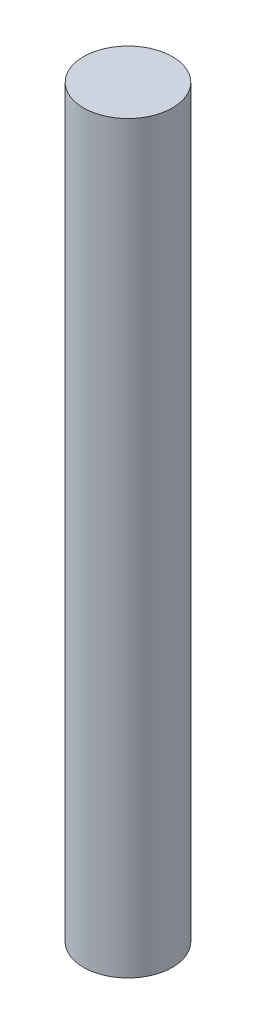
ISO-10303-21;
HEADER;
FILE_DESCRIPTION(('STEP AP214'),'2;1');
FILE_NAME('part.step','',(''),(''),'','','');
FILE_SCHEMA(('AUTOMOTIVE_DESIGN { 1 0 10303 214 1 1 1 1 }'));
ENDSEC;
DATA;
#1=APPLICATION_CONTEXT('core data for automotive mechanical design processes');
#2=APPLICATION_PROTOCOL_DEFINITION('international standard','automotive_design',2000,#1);
#3=PRODUCT_CONTEXT('',#1,'mechanical');
#4=PRODUCT('Part','Part','',(#3));
#5=PRODUCT_RELATED_PRODUCT_CATEGORY('part','',(#4));
#6=PRODUCT_DEFINITION_FORMATION('','',#4);
#7=PRODUCT_DEFINITION_CONTEXT('part definition',#1,'design');
#8=PRODUCT_DEFINITION('design','',#6,#7);
#9=PRODUCT_DEFINITION_SHAPE('','',#8);
#10=(LENGTH_UNIT() NAMED_UNIT(*) SI_UNIT(.MILLI.,.METRE.));
#11=(NAMED_UNIT(*) PLANE_ANGLE_UNIT() SI_UNIT($,.RADIAN.));
#12=(NAMED_UNIT(*) SI_UNIT($,.STERADIAN.) SOLID_ANGLE_UNIT());
#13=UNCERTAINTY_MEASURE_WITH_UNIT(LENGTH_MEASURE(1.E-05),#10,'distance_accuracy_value','');
#14=(GEOMETRIC_REPRESENTATION_CONTEXT(3) GLOBAL_UNCERTAINTY_ASSIGNED_CONTEXT((#13)) GLOBAL_UNIT_ASSIGNED_CONTEXT((#10,
#11,#12)) REPRESENTATION_CONTEXT('',''));
#15=CARTESIAN_POINT('',(0.,0.,0.));
#16=DIRECTION('',(0.,0.,1.));
#17=DIRECTION('',(1.,0.,0.));
#18=AXIS2_PLACEMENT_3D('',#15,#16,#17);
#19=CARTESIAN_POINT('',(0.,134.,0.));
#20=DIRECTION('',(0.,-1.,0.));
#21=DIRECTION('',(0.,0.,-1.));
#22=AXIS2_PLACEMENT_3D('',#19,#20,#21);
#23=CYLINDRICAL_SURFACE('',#22,8.);
#24=CARTESIAN_POINT('',(0.,134.,0.));
#25=DIRECTION('',(0.,1.,0.));
#26=DIRECTION('',(0.,0.,1.));
#27=AXIS2_PLACEMENT_3D('',#24,#25,#26);
#28=CIRCLE('',#27,8.);
#29=CARTESIAN_POINT('',(0.,134.,8.));
#30=VERTEX_POINT('',#29);
#31=EDGE_CURVE('E10',#30,#30,#28,.T.);
#32=ORIENTED_EDGE('',*,*,#31,.F.);
#33=EDGE_LOOP('',(#32));
#34=FACE_BOUND('',#33,.T.);
#35=CARTESIAN_POINT('',(0.,0.,0.));
#36=DIRECTION('',(0.,1.,0.));
#37=DIRECTION('',(0.,0.,1.));
#38=AXIS2_PLACEMENT_3D('',#35,#36,#37);
#39=CIRCLE('',#38,8.);
#40=CARTESIAN_POINT('',(0.,0.,8.));
#41=VERTEX_POINT('',#40);
#42=EDGE_CURVE('E33',#41,#41,#39,.T.);
#43=ORIENTED_EDGE('',*,*,#42,.T.);
#44=EDGE_LOOP('',(#43));
#45=FACE_BOUND('',#44,.T.);
#46=ADVANCED_FACE('F30',(#34,#45),#23,.T.);
#47=CARTESIAN_POINT('',(0.,134.,0.));
#48=DIRECTION('',(0.,1.,0.));
#49=DIRECTION('',(0.,0.,1.));
#50=AXIS2_PLACEMENT_3D('',#47,#48,#49);
#51=PLANE('',#50);
#52=ORIENTED_EDGE('',*,*,#31,.T.);
#53=EDGE_LOOP('',(#52));
#54=FACE_BOUND('',#53,.T.);
#55=ADVANCED_FACE('F45',(#54),#51,.T.);
#56=CARTESIAN_POINT('',(0.,0.,0.));
#57=DIRECTION('',(0.,1.,0.));
#58=DIRECTION('',(0.,0.,1.));
#59=AXIS2_PLACEMENT_3D('',#56,#57,#58);
#60=PLANE('',#59);
#61=ORIENTED_EDGE('',*,*,#42,.F.);
#62=EDGE_LOOP('',(#61));
#63=FACE_BOUND('',#62,.T.);
#64=ADVANCED_FACE('F43',(#63),#60,.F.);
#65=CLOSED_SHELL('',(#46,#55,#64));
#66=MANIFOLD_SOLID_BREP('B2',#65);
#67=ADVANCED_BREP_SHAPE_REPRESENTATION('',(#18,#66),#14);
#68=SHAPE_DEFINITION_REPRESENTATION(#9,#67);
ENDSEC;
END-ISO-10303-21;
